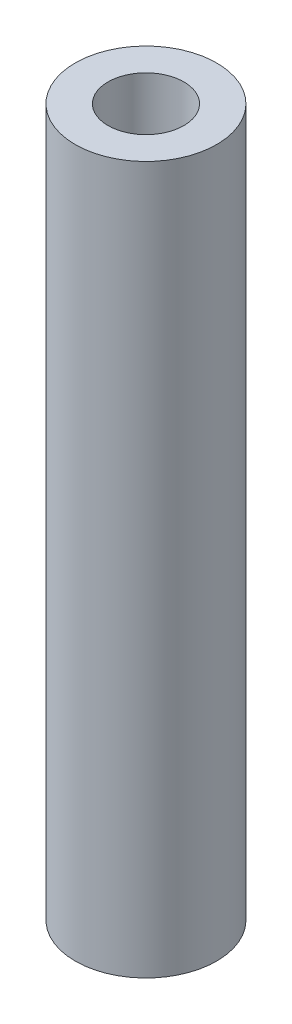
ISO-10303-21;
HEADER;
FILE_DESCRIPTION(('STEP AP214'),'2;1');
FILE_NAME('part.step','',(''),(''),'','','');
FILE_SCHEMA(('AUTOMOTIVE_DESIGN { 1 0 10303 214 1 1 1 1 }'));
ENDSEC;
DATA;
#1=APPLICATION_CONTEXT('core data for automotive mechanical design processes');
#2=APPLICATION_PROTOCOL_DEFINITION('international standard','automotive_design',2000,#1);
#3=PRODUCT_CONTEXT('',#1,'mechanical');
#4=PRODUCT('Part','Part','',(#3));
#5=PRODUCT_RELATED_PRODUCT_CATEGORY('part','',(#4));
#6=PRODUCT_DEFINITION_FORMATION('','',#4);
#7=PRODUCT_DEFINITION_CONTEXT('part definition',#1,'design');
#8=PRODUCT_DEFINITION('design','',#6,#7);
#9=PRODUCT_DEFINITION_SHAPE('','',#8);
#10=(LENGTH_UNIT() NAMED_UNIT(*) SI_UNIT(.MILLI.,.METRE.));
#11=(NAMED_UNIT(*) PLANE_ANGLE_UNIT() SI_UNIT($,.RADIAN.));
#12=(NAMED_UNIT(*) SI_UNIT($,.STERADIAN.) SOLID_ANGLE_UNIT());
#13=UNCERTAINTY_MEASURE_WITH_UNIT(LENGTH_MEASURE(1.E-05),#10,'distance_accuracy_value','');
#14=(GEOMETRIC_REPRESENTATION_CONTEXT(3) GLOBAL_UNCERTAINTY_ASSIGNED_CONTEXT((#13)) GLOBAL_UNIT_ASSIGNED_CONTEXT((#10,
#11,#12)) REPRESENTATION_CONTEXT('',''));
#15=CARTESIAN_POINT('',(0.,0.,0.));
#16=DIRECTION('',(0.,0.,1.));
#17=DIRECTION('',(1.,0.,0.));
#18=AXIS2_PLACEMENT_3D('',#15,#16,#17);
#19=CARTESIAN_POINT('',(0.,31.75,0.));
#20=DIRECTION('',(0.,1.,0.));
#21=DIRECTION('',(0.,0.,1.));
#22=AXIS2_PLACEMENT_3D('',#19,#20,#21);
#23=PLANE('',#22);
#24=CARTESIAN_POINT('',(0.,31.75,0.));
#25=DIRECTION('',(0.,1.,0.));
#26=DIRECTION('',(0.,0.,1.));
#27=AXIS2_PLACEMENT_3D('',#24,#25,#26);
#28=CIRCLE('',#27,3.175);
#29=CARTESIAN_POINT('',(0.,31.75,3.175));
#30=VERTEX_POINT('',#29);
#31=EDGE_CURVE('E10',#30,#30,#28,.T.);
#32=ORIENTED_EDGE('',*,*,#31,.T.);
#33=EDGE_LOOP('',(#32));
#34=FACE_BOUND('',#33,.T.);
#35=CARTESIAN_POINT('',(0.,31.75,0.));
#36=DIRECTION('',(0.,1.,0.));
#37=DIRECTION('',(0.,0.,1.));
#38=AXIS2_PLACEMENT_3D('',#35,#36,#37);
#39=CIRCLE('',#38,1.7018);
#40=CARTESIAN_POINT('',(0.,31.75,1.7018));
#41=VERTEX_POINT('',#40);
#42=EDGE_CURVE('E369',#41,#41,#39,.T.);
#43=ORIENTED_EDGE('',*,*,#42,.F.);
#44=EDGE_LOOP('',(#43));
#45=FACE_BOUND('',#44,.T.);
#46=ADVANCED_FACE('F358',(#34,#45),#23,.T.);
#47=CARTESIAN_POINT('',(0.,0.,0.));
#48=DIRECTION('',(0.,1.,0.));
#49=DIRECTION('',(0.,0.,1.));
#50=AXIS2_PLACEMENT_3D('',#47,#48,#49);
#51=PLANE('',#50);
#52=CARTESIAN_POINT('',(0.,0.,0.));
#53=DIRECTION('',(0.,1.,0.));
#54=DIRECTION('',(0.,0.,1.));
#55=AXIS2_PLACEMENT_3D('',#52,#53,#54);
#56=CIRCLE('',#55,3.175);
#57=CARTESIAN_POINT('',(0.,0.,3.175));
#58=VERTEX_POINT('',#57);
#59=EDGE_CURVE('E365',#58,#58,#56,.T.);
#60=ORIENTED_EDGE('',*,*,#59,.F.);
#61=EDGE_LOOP('',(#60));
#62=FACE_BOUND('',#61,.T.);
#63=CARTESIAN_POINT('',(0.,0.,0.));
#64=DIRECTION('',(0.,1.,0.));
#65=DIRECTION('',(0.,0.,1.));
#66=AXIS2_PLACEMENT_3D('',#63,#64,#65);
#67=CIRCLE('',#66,1.7018);
#68=CARTESIAN_POINT('',(0.,0.,1.7018));
#69=VERTEX_POINT('',#68);
#70=EDGE_CURVE('E373',#69,#69,#67,.T.);
#71=ORIENTED_EDGE('',*,*,#70,.T.);
#72=EDGE_LOOP('',(#71));
#73=FACE_BOUND('',#72,.T.);
#74=ADVANCED_FACE('F379',(#62,#73),#51,.F.);
#75=CARTESIAN_POINT('',(0.,31.75,0.));
#76=DIRECTION('',(0.,-1.,0.));
#77=DIRECTION('',(0.,0.,-1.));
#78=AXIS2_PLACEMENT_3D('',#75,#76,#77);
#79=CYLINDRICAL_SURFACE('',#78,3.175);
#80=ORIENTED_EDGE('',*,*,#31,.F.);
#81=EDGE_LOOP('',(#80));
#82=FACE_BOUND('',#81,.T.);
#83=ORIENTED_EDGE('',*,*,#59,.T.);
#84=EDGE_LOOP('',(#83));
#85=FACE_BOUND('',#84,.T.);
#86=ADVANCED_FACE('F360',(#82,#85),#79,.T.);
#87=CARTESIAN_POINT('',(0.,31.75,0.));
#88=DIRECTION('',(0.,-1.,0.));
#89=DIRECTION('',(0.,0.,-1.));
#90=AXIS2_PLACEMENT_3D('',#87,#88,#89);
#91=CYLINDRICAL_SURFACE('',#90,1.7018);
#92=ORIENTED_EDGE('',*,*,#42,.T.);
#93=EDGE_LOOP('',(#92));
#94=FACE_BOUND('',#93,.T.);
#95=ORIENTED_EDGE('',*,*,#70,.F.);
#96=EDGE_LOOP('',(#95));
#97=FACE_BOUND('',#96,.T.);
#98=ADVANCED_FACE('F381',(#94,#97),#91,.F.);
#99=CLOSED_SHELL('',(#46,#74,#86,#98));
#100=MANIFOLD_SOLID_BREP('B2',#99);
#101=ADVANCED_BREP_SHAPE_REPRESENTATION('',(#18,#100),#14);
#102=SHAPE_DEFINITION_REPRESENTATION(#9,#101);
ENDSEC;
END-ISO-10303-21;
